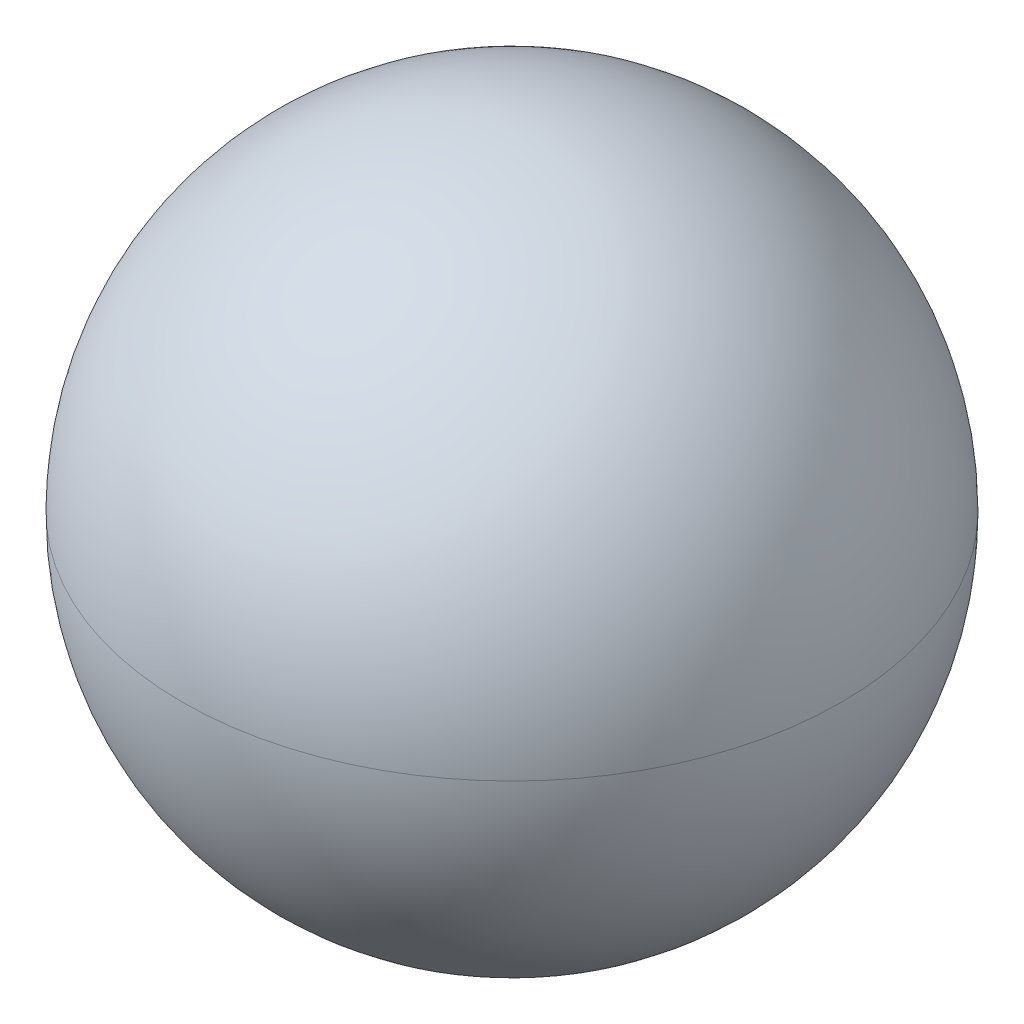
ISO-10303-21;
HEADER;
FILE_DESCRIPTION(('STEP AP214'),'2;1');
FILE_NAME('part.step','',(''),(''),'','','');
FILE_SCHEMA(('AUTOMOTIVE_DESIGN { 1 0 10303 214 1 1 1 1 }'));
ENDSEC;
DATA;
#1=APPLICATION_CONTEXT('core data for automotive mechanical design processes');
#2=APPLICATION_PROTOCOL_DEFINITION('international standard','automotive_design',2000,#1);
#3=PRODUCT_CONTEXT('',#1,'mechanical');
#4=PRODUCT('Part','Part','',(#3));
#5=PRODUCT_RELATED_PRODUCT_CATEGORY('part','',(#4));
#6=PRODUCT_DEFINITION_FORMATION('','',#4);
#7=PRODUCT_DEFINITION_CONTEXT('part definition',#1,'design');
#8=PRODUCT_DEFINITION('design','',#6,#7);
#9=PRODUCT_DEFINITION_SHAPE('','',#8);
#10=(LENGTH_UNIT() NAMED_UNIT(*) SI_UNIT(.MILLI.,.METRE.));
#11=(NAMED_UNIT(*) PLANE_ANGLE_UNIT() SI_UNIT($,.RADIAN.));
#12=(NAMED_UNIT(*) SI_UNIT($,.STERADIAN.) SOLID_ANGLE_UNIT());
#13=UNCERTAINTY_MEASURE_WITH_UNIT(LENGTH_MEASURE(1.E-05),#10,'distance_accuracy_value','');
#14=(GEOMETRIC_REPRESENTATION_CONTEXT(3) GLOBAL_UNCERTAINTY_ASSIGNED_CONTEXT((#13)) GLOBAL_UNIT_ASSIGNED_CONTEXT((#10,
#11,#12)) REPRESENTATION_CONTEXT('',''));
#15=CARTESIAN_POINT('',(0.,0.,0.));
#16=DIRECTION('',(0.,0.,1.));
#17=DIRECTION('',(1.,0.,0.));
#18=AXIS2_PLACEMENT_3D('',#15,#16,#17);
#19=CARTESIAN_POINT('',(0.,0.,0.));
#20=DIRECTION('',(0.,-1.,0.));
#21=DIRECTION('',(1.,0.,0.));
#22=AXIS2_PLACEMENT_3D('',#19,#20,#21);
#23=SPHERICAL_SURFACE('',#22,1.5);
#24=CARTESIAN_POINT('',(0.,0.,0.));
#25=DIRECTION('',(0.,-1.,0.));
#26=DIRECTION('',(1.,0.,0.));
#27=AXIS2_PLACEMENT_3D('',#24,#25,#26);
#28=CIRCLE('',#27,1.5);
#29=CARTESIAN_POINT('',(0.,0.,1.5));
#30=VERTEX_POINT('',#29);
#31=CARTESIAN_POINT('',(0.,0.,-1.5));
#32=VERTEX_POINT('',#31);
#33=EDGE_CURVE('E11',#30,#32,#28,.T.);
#34=ORIENTED_EDGE('',*,*,#33,.F.);
#35=CARTESIAN_POINT('',(0.,0.,0.));
#36=DIRECTION('',(0.,1.,0.));
#37=DIRECTION('',(0.,0.,1.));
#38=AXIS2_PLACEMENT_3D('',#35,#36,#37);
#39=CIRCLE('',#38,1.5);
#40=EDGE_CURVE('E26',#30,#32,#39,.T.);
#41=ORIENTED_EDGE('',*,*,#40,.T.);
#42=EDGE_LOOP('',(#34,#41));
#43=FACE_BOUND('',#42,.T.);
#44=ADVANCED_FACE('F17',(#43),#23,.T.);
#45=CARTESIAN_POINT('',(0.,0.,0.));
#46=DIRECTION('',(0.,-1.,0.));
#47=DIRECTION('',(1.,0.,0.));
#48=AXIS2_PLACEMENT_3D('',#45,#46,#47);
#49=SPHERICAL_SURFACE('',#48,1.5);
#50=ORIENTED_EDGE('',*,*,#40,.F.);
#51=ORIENTED_EDGE('',*,*,#33,.T.);
#52=EDGE_LOOP('',(#50,#51));
#53=FACE_BOUND('',#52,.T.);
#54=ADVANCED_FACE('F19',(#53),#49,.T.);
#55=CLOSED_SHELL('',(#44,#54));
#56=MANIFOLD_SOLID_BREP('B1',#55);
#57=ADVANCED_BREP_SHAPE_REPRESENTATION('',(#18,#56),#14);
#58=SHAPE_DEFINITION_REPRESENTATION(#9,#57);
ENDSEC;
END-ISO-10303-21;
